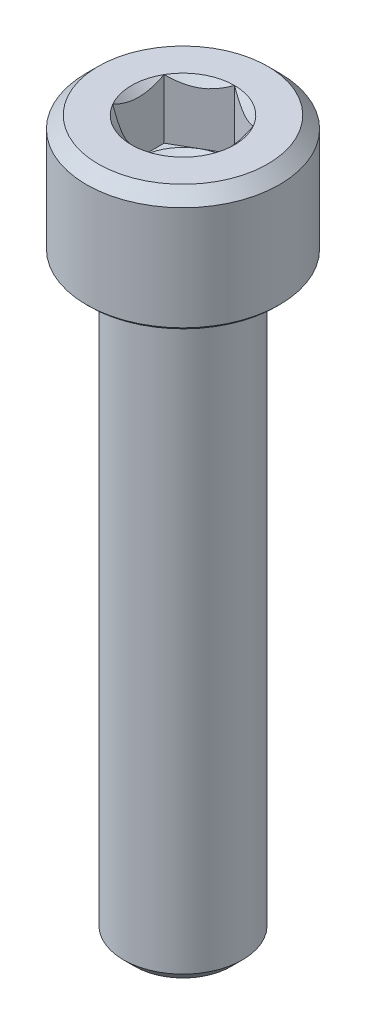
ISO-10303-21;
HEADER;
FILE_DESCRIPTION(('STEP AP214'),'2;1');
FILE_NAME('part.step','',(''),(''),'','','');
FILE_SCHEMA(('AUTOMOTIVE_DESIGN { 1 0 10303 214 1 1 1 1 }'));
ENDSEC;
DATA;
#1=APPLICATION_CONTEXT('core data for automotive mechanical design processes');
#2=APPLICATION_PROTOCOL_DEFINITION('international standard','automotive_design',2000,#1);
#3=PRODUCT_CONTEXT('',#1,'mechanical');
#4=PRODUCT('Part','Part','',(#3));
#5=PRODUCT_RELATED_PRODUCT_CATEGORY('part','',(#4));
#6=PRODUCT_DEFINITION_FORMATION('','',#4);
#7=PRODUCT_DEFINITION_CONTEXT('part definition',#1,'design');
#8=PRODUCT_DEFINITION('design','',#6,#7);
#9=PRODUCT_DEFINITION_SHAPE('','',#8);
#10=(LENGTH_UNIT() NAMED_UNIT(*) SI_UNIT(.MILLI.,.METRE.));
#11=(NAMED_UNIT(*) PLANE_ANGLE_UNIT() SI_UNIT($,.RADIAN.));
#12=(NAMED_UNIT(*) SI_UNIT($,.STERADIAN.) SOLID_ANGLE_UNIT());
#13=UNCERTAINTY_MEASURE_WITH_UNIT(LENGTH_MEASURE(1.E-05),#10,'distance_accuracy_value','');
#14=(GEOMETRIC_REPRESENTATION_CONTEXT(3) GLOBAL_UNCERTAINTY_ASSIGNED_CONTEXT((#13)) GLOBAL_UNIT_ASSIGNED_CONTEXT((#10,
#11,#12)) REPRESENTATION_CONTEXT('',''));
#15=CARTESIAN_POINT('',(0.,0.,0.));
#16=DIRECTION('',(0.,0.,1.));
#17=DIRECTION('',(1.,0.,0.));
#18=AXIS2_PLACEMENT_3D('',#15,#16,#17);
#19=CARTESIAN_POINT('',(0.,8.,0.));
#20=DIRECTION('',(0.,1.,0.));
#21=DIRECTION('',(0.,0.,1.));
#22=AXIS2_PLACEMENT_3D('',#19,#20,#21);
#23=CONICAL_SURFACE('',#22,3.4641016151378,0.785398163397452);
#24=CARTESIAN_POINT('',(0.,8.,0.));
#25=DIRECTION('',(0.,1.,0.));
#26=DIRECTION('',(0.,0.,1.));
#27=AXIS2_PLACEMENT_3D('',#24,#25,#26);
#28=CIRCLE('',#27,3.4641016151378);
#29=CARTESIAN_POINT('',(-3.,8.,-1.7320508075689));
#30=VERTEX_POINT('',#29);
#31=CARTESIAN_POINT('',(-3.00000000000006,8.,1.73205080756887));
#32=VERTEX_POINT('',#31);
#33=EDGE_CURVE('E247',#30,#32,#28,.T.);
#34=ORIENTED_EDGE('',*,*,#33,.T.);
#35=CARTESIAN_POINT('',(-3.,10.5628957611466,5.22730306886255));
#36=CARTESIAN_POINT('',(-3.,10.4288342117401,5.0726713580434));
#37=CARTESIAN_POINT('',(-3.,10.2955494854444,4.91735177230274));
#38=CARTESIAN_POINT('',(-3.,10.0310881377474,4.60480359274617));
#39=CARTESIAN_POINT('',(-3.,9.89991254962811,4.4475741257295));
#40=CARTESIAN_POINT('',(-3.,9.63736618129847,4.12717460522465));
#41=CARTESIAN_POINT('',(-3.,9.50606037443135,3.96395110833711));
#42=CARTESIAN_POINT('',(-3.,9.24743623977035,3.63442449981236));
#43=CARTESIAN_POINT('',(-3.,9.12011692066784,3.46812217041284));
#44=CARTESIAN_POINT('',(-3.,8.87081667139496,3.13119610603762));
#45=CARTESIAN_POINT('',(-3.,8.74884313339933,2.96056687208659));
#46=CARTESIAN_POINT('',(-3.,8.51272102939345,2.61368555328836));
#47=CARTESIAN_POINT('',(-3.,8.39857888119803,2.43742902617456));
#48=CARTESIAN_POINT('',(-3.,8.23676937618543,2.16829069832486));
#49=CARTESIAN_POINT('',(-3.,8.18458231743954,2.07813994406703));
#50=CARTESIAN_POINT('',(-3.,8.08389799079683,1.89580695482969));
#51=CARTESIAN_POINT('',(-3.,8.03540116735631,1.80362447686586));
#52=CARTESIAN_POINT('',(-3.,7.89685543297179,1.52391319393506));
#53=CARTESIAN_POINT('',(-3.,7.81351649159878,1.33284385060797));
#54=CARTESIAN_POINT('',(-3.,7.70855409405216,1.03657424381741));
#55=CARTESIAN_POINT('',(-3.,7.67666695663458,0.935006758603606));
#56=CARTESIAN_POINT('',(-3.,7.62172632743353,0.729476390859867));
#57=CARTESIAN_POINT('',(-3.,7.59867142567072,0.625513893481614));
#58=CARTESIAN_POINT('',(-3.,7.56292742524803,0.41645059180014));
#59=CARTESIAN_POINT('',(-3.,7.55017520011951,0.311360779912042));
#60=CARTESIAN_POINT('',(-3.,7.53573503655797,0.100416824431796));
#61=CARTESIAN_POINT('',(-3.,7.53404593599852,-0.00543723771015925));
#62=CARTESIAN_POINT('',(-3.,7.54186740554813,-0.216859496187063));
#63=CARTESIAN_POINT('',(-3.,7.55139258649607,-0.322427139576685));
#64=CARTESIAN_POINT('',(-3.,7.5809459928178,-0.532070977320128));
#65=CARTESIAN_POINT('',(-3.,7.60097628641626,-0.636146873835313));
#66=CARTESIAN_POINT('',(-3.,7.65040446804356,-0.842791568937395));
#67=CARTESIAN_POINT('',(-3.,7.6798678340041,-0.945344427978178));
#68=CARTESIAN_POINT('',(-3.,7.7465698690676,-1.14784963750902));
#69=CARTESIAN_POINT('',(-3.,7.78380862419282,-1.24780195921453));
#70=CARTESIAN_POINT('',(-3.,7.87370029414245,-1.46734471854927));
#71=CARTESIAN_POINT('',(-3.,7.92793554732397,-1.58628178717262));
#72=CARTESIAN_POINT('',(-3.,8.04363956081995,-1.82061432614214));
#73=CARTESIAN_POINT('',(-3.,8.10511250042274,-1.93600770127382));
#74=CARTESIAN_POINT('',(-3.,8.23368444704772,-2.1639059086434));
#75=CARTESIAN_POINT('',(-3.,8.30079484504482,-2.27640426187093));
#76=CARTESIAN_POINT('',(-3.,8.43923767799413,-2.49872291673084));
#77=CARTESIAN_POINT('',(-3.,8.51056927359537,-2.60854374467607));
#78=CARTESIAN_POINT('',(-3.,8.65691390595835,-2.82654030533701));
#79=CARTESIAN_POINT('',(-3.,8.73194446444504,-2.93470422093315));
#80=CARTESIAN_POINT('',(-3.,8.88464064031789,-3.14916031477082));
#81=CARTESIAN_POINT('',(-3.,8.96230645630098,-3.25545235102371));
#82=CARTESIAN_POINT('',(-3.,9.19824479870631,-3.5717347626675));
#83=CARTESIAN_POINT('',(-3.,9.35963841020625,-3.77939404666679));
#84=CARTESIAN_POINT('',(-3.,9.69321446971949,-4.19691408704107));
#85=CARTESIAN_POINT('',(-3.,9.86557700910658,-4.40662953794659));
#86=CARTESIAN_POINT('',(-3.,10.1262359169538,-4.71751939796388));
#87=CARTESIAN_POINT('',(-3.,10.212996792795,-4.81998746341153));
#88=CARTESIAN_POINT('',(-3.,10.3873521918902,-5.02417406398527));
#89=CARTESIAN_POINT('',(-3.,10.4749465316673,-5.12589275571193));
#90=CARTESIAN_POINT('',(-3.,10.5628957611466,-5.22730306886255));
#91=B_SPLINE_CURVE_WITH_KNOTS('',3,(#35,#36,#37,#38,#39,#40,#41,#42,#43,#44,#45,#46,#47,#48,#49,
#50,#51,#52,#53,#54,#55,#56,#57,#58,#59,#60,#61,#62,#63,#64,#65,#66,#67,#68,#69,#70,#71,#72,#73,
#74,#75,#76,#77,#78,#79,#80,#81,#82,#83,#84,#85,#86,#87,#88,#89,#90),.UNSPECIFIED.,.F.,.F.,(4,2,
2,2,2,2,2,2,2,2,2,2,2,2,2,2,2,2,2,2,2,2,2,2,2,2,2,4),(0.,0.613977244046406,1.22824663827751,
1.8566516828457,2.48489920225136,3.11398969259724,3.74358971179074,4.05600538101289,
4.36845861858335,4.99203707824936,5.31109326862459,5.63009850357821,5.94713398460898,
6.26413616209869,6.58155181217515,6.89902997785464,7.2187614604173,7.53849648048523,
7.93032123433355,8.32237336123124,8.71523765064269,9.10802408295755,9.50289413535101,
9.89779401212494,10.6866391110132,11.5009473099341,11.9037392215787,12.3064444255475),.UNSPECIFIED.);
#92=EDGE_CURVE('E134',#32,#30,#91,.T.);
#93=ORIENTED_EDGE('',*,*,#92,.T.);
#94=EDGE_LOOP('',(#34,#93));
#95=FACE_BOUND('',#94,.T.);
#96=ADVANCED_FACE('F42',(#95),#23,.F.);
#97=CARTESIAN_POINT('',(0.,8.,-3.4641016151378));
#98=VERTEX_POINT('',#97);
#99=EDGE_CURVE('E249',#98,#30,#28,.T.);
#100=ORIENTED_EDGE('',*,*,#99,.T.);
#101=CARTESIAN_POINT('',(-3.0002,8.00011547582711,-1.73193533751506));
#102=CARTESIAN_POINT('',(-2.89707648504425,7.94062831832175,-1.79147372663454));
#103=CARTESIAN_POINT('',(-2.79222861066935,7.88463497946549,-1.85200767512885));
#104=CARTESIAN_POINT('',(-2.57843232821891,7.78211259637891,-1.97544301635336));
#105=CARTESIAN_POINT('',(-2.46946358862025,7.73564059374127,-2.0383561474939));
#106=CARTESIAN_POINT('',(-2.24973336040298,7.65603318851628,-2.16521745390424));
#107=CARTESIAN_POINT('',(-2.1390278282378,7.62269770064265,-2.22913332270059));
#108=CARTESIAN_POINT('',(-1.91517958943469,7.57133754397929,-2.35837216363119));
#109=CARTESIAN_POINT('',(-1.80204372079302,7.55327453753559,-2.42369118784646));
#110=CARTESIAN_POINT('',(-1.60705904380731,7.53697690845048,-2.53626564359201));
#111=CARTESIAN_POINT('',(-1.52546204599788,7.53456436717379,-2.58337569224236));
#112=CARTESIAN_POINT('',(-1.36240077116992,7.5386294346571,-2.67751916315868));
#113=CARTESIAN_POINT('',(-1.28093655070102,7.54511016002829,-2.72455255277572));
#114=CARTESIAN_POINT('',(-1.11877988766164,7.56659172251521,-2.81817374583241));
#115=CARTESIAN_POINT('',(-1.03808841121571,7.58160208996727,-2.86476099147977));
#116=CARTESIAN_POINT('',(-0.878091302108671,7.61932364606601,-2.95713536549228));
#117=CARTESIAN_POINT('',(-0.798785563690709,7.64203424432282,-3.00292255491618));
#118=CARTESIAN_POINT('',(-0.657993859197251,7.68876068485394,-3.08420868340514));
#119=CARTESIAN_POINT('',(-0.596196277853978,7.71154832768079,-3.11988753362895));
#120=CARTESIAN_POINT('',(-0.473710582479783,7.76079628605744,-3.19060468282512));
#121=CARTESIAN_POINT('',(-0.413022502364399,7.78725671366619,-3.22564296221634));
#122=CARTESIAN_POINT('',(-0.292947002609139,7.84325699439136,-3.29496858432312));
#123=CARTESIAN_POINT('',(-0.233556167704084,7.87278716447837,-3.32925789884295));
#124=CARTESIAN_POINT('',(-0.115874438532732,7.93453909157553,-3.39720147685873));
#125=CARTESIAN_POINT('',(-0.0575828957522661,7.96675919665935,-3.43085611477451));
#126=CARTESIAN_POINT('',(0.000200000000000316,8.00011547582715,-3.46421708519164));
#127=B_SPLINE_CURVE_WITH_KNOTS('',3,(#101,#102,#103,#104,#105,#106,#107,#108,#109,#110,#111,
#112,#113,#114,#115,#116,#117,#118,#119,#120,#121,#122,#123,#124,#125,#126),.UNSPECIFIED.,.F.,
.F.,(4,2,2,2,2,2,2,2,2,2,2,2,4),(0.,0.399603557139301,0.801535286397836,1.19708369162341,
1.59163620080171,1.87398941755843,2.15644160919092,2.43921001247424,2.72195674032138,
2.94657516661927,3.17120044767275,3.3951375283781,3.6189380838074),.UNSPECIFIED.);
#128=EDGE_CURVE('E209',#30,#98,#127,.T.);
#129=ORIENTED_EDGE('',*,*,#128,.T.);
#130=EDGE_LOOP('',(#100,#129));
#131=FACE_BOUND('',#130,.T.);
#132=ADVANCED_FACE('F293',(#131),#23,.F.);
#133=CARTESIAN_POINT('',(3.,8.,-1.7320508075689));
#134=VERTEX_POINT('',#133);
#135=EDGE_CURVE('E246',#134,#98,#28,.T.);
#136=ORIENTED_EDGE('',*,*,#135,.T.);
#137=CARTESIAN_POINT('',(-0.000200000000000127,8.00011547582715,-3.46421708519164));
#138=CARTESIAN_POINT('',(0.10292351495575,7.94062831832178,-3.40467869607216));
#139=CARTESIAN_POINT('',(0.207771389330655,7.88463497946552,-3.34414474757784));
#140=CARTESIAN_POINT('',(0.421567671781105,7.78211259637893,-3.22070940635333));
#141=CARTESIAN_POINT('',(0.530536411379772,7.73564059374128,-3.15779627521279));
#142=CARTESIAN_POINT('',(0.750266639597046,7.65603318851629,-3.03093496880244));
#143=CARTESIAN_POINT('',(0.860972171762232,7.62269770064266,-2.96701910000609));
#144=CARTESIAN_POINT('',(1.08482041056535,7.57133754397929,-2.83778025907549));
#145=CARTESIAN_POINT('',(1.19795627920702,7.55327453753559,-2.77246123486021));
#146=CARTESIAN_POINT('',(1.39294095619273,7.53697690845048,-2.65988677911466));
#147=CARTESIAN_POINT('',(1.47453795400217,7.53456436717379,-2.61277673046432));
#148=CARTESIAN_POINT('',(1.63759922883013,7.5386294346571,-2.51863325954799));
#149=CARTESIAN_POINT('',(1.71906344929903,7.54511016002829,-2.47159986993095));
#150=CARTESIAN_POINT('',(1.88122011233841,7.56659172251521,-2.37797867687427));
#151=CARTESIAN_POINT('',(1.96191158878434,7.58160208996727,-2.3313914312269));
#152=CARTESIAN_POINT('',(2.12190869789138,7.619323646066,-2.23901705721439));
#153=CARTESIAN_POINT('',(2.20121443630934,7.64203424432282,-2.1932298677905));
#154=CARTESIAN_POINT('',(2.34200614080279,7.68876068485393,-2.11194373930153));
#155=CARTESIAN_POINT('',(2.40380372214606,7.71154832768079,-2.07626488907773));
#156=CARTESIAN_POINT('',(2.52628941752025,7.76079628605743,-2.00554773988156));
#157=CARTESIAN_POINT('',(2.58697749763563,7.78725671366618,-1.97050946049035));
#158=CARTESIAN_POINT('',(2.70705299739088,7.84325699439134,-1.90118383838357));
#159=CARTESIAN_POINT('',(2.76644383229593,7.87278716447835,-1.86689452386374));
#160=CARTESIAN_POINT('',(2.88412556146728,7.9345390915755,-1.79895094584797));
#161=CARTESIAN_POINT('',(2.94241710424774,7.96675919665932,-1.76529630793219));
#162=CARTESIAN_POINT('',(3.0002,8.00011547582711,-1.73193533751506));
#163=B_SPLINE_CURVE_WITH_KNOTS('',3,(#137,#138,#139,#140,#141,#142,#143,#144,#145,#146,#147,
#148,#149,#150,#151,#152,#153,#154,#155,#156,#157,#158,#159,#160,#161,#162),.UNSPECIFIED.,.F.,
.F.,(4,2,2,2,2,2,2,2,2,2,2,2,4),(0.,0.399603557139317,0.801535286397867,1.19708369162346,
1.59163620080177,1.87398941755849,2.15644160919098,2.43921001247431,2.72195674032144,
2.94657516661932,3.17120044767278,3.39513752837812,3.6189380838074),.UNSPECIFIED.);
#164=EDGE_CURVE('E260',#98,#134,#163,.T.);
#165=ORIENTED_EDGE('',*,*,#164,.T.);
#166=EDGE_LOOP('',(#136,#165));
#167=FACE_BOUND('',#166,.T.);
#168=ADVANCED_FACE('F258',(#167),#23,.F.);
#169=CARTESIAN_POINT('',(3.,8.,1.7320508075689));
#170=VERTEX_POINT('',#169);
#171=EDGE_CURVE('E241',#170,#134,#28,.T.);
#172=ORIENTED_EDGE('',*,*,#171,.T.);
#173=CARTESIAN_POINT('',(3.,10.5628957611466,-5.22730306886255));
#174=CARTESIAN_POINT('',(3.,10.4288342117401,-5.0726713580434));
#175=CARTESIAN_POINT('',(3.,10.2955494854444,-4.91735177230274));
#176=CARTESIAN_POINT('',(3.,10.0310881377474,-4.60480359274617));
#177=CARTESIAN_POINT('',(3.,9.89991254962811,-4.4475741257295));
#178=CARTESIAN_POINT('',(3.,9.63736618129847,-4.12717460522465));
#179=CARTESIAN_POINT('',(3.,9.50606037443135,-3.96395110833711));
#180=CARTESIAN_POINT('',(3.,9.24743623977035,-3.63442449981236));
#181=CARTESIAN_POINT('',(3.,9.12011692066784,-3.46812217041284));
#182=CARTESIAN_POINT('',(3.,8.87081667139496,-3.13119610603762));
#183=CARTESIAN_POINT('',(3.,8.74884313339933,-2.96056687208659));
#184=CARTESIAN_POINT('',(3.,8.51272102939345,-2.61368555328836));
#185=CARTESIAN_POINT('',(3.,8.39857888119803,-2.43742902617456));
#186=CARTESIAN_POINT('',(3.,8.23676937618543,-2.16829069832486));
#187=CARTESIAN_POINT('',(3.,8.18458231743954,-2.07813994406703));
#188=CARTESIAN_POINT('',(3.,8.08389799079683,-1.89580695482969));
#189=CARTESIAN_POINT('',(3.,8.03540116735631,-1.80362447686586));
#190=CARTESIAN_POINT('',(3.,7.89685543297179,-1.52391319393506));
#191=CARTESIAN_POINT('',(3.,7.81351649159878,-1.33284385060797));
#192=CARTESIAN_POINT('',(3.,7.70855409405216,-1.03657424381741));
#193=CARTESIAN_POINT('',(3.,7.67666695663458,-0.935006758603606));
#194=CARTESIAN_POINT('',(3.,7.62172632743353,-0.729476390859867));
#195=CARTESIAN_POINT('',(3.,7.59867142567072,-0.625513893481614));
#196=CARTESIAN_POINT('',(3.,7.56292742524803,-0.41645059180014));
#197=CARTESIAN_POINT('',(3.,7.55017520011951,-0.311360779912042));
#198=CARTESIAN_POINT('',(3.,7.53573503655797,-0.100416824431796));
#199=CARTESIAN_POINT('',(3.,7.53404593599852,0.00543723771015925));
#200=CARTESIAN_POINT('',(3.,7.54186740554813,0.216859496187063));
#201=CARTESIAN_POINT('',(3.,7.55139258649607,0.322427139576685));
#202=CARTESIAN_POINT('',(3.,7.5809459928178,0.532070977320128));
#203=CARTESIAN_POINT('',(3.,7.60097628641626,0.636146873835313));
#204=CARTESIAN_POINT('',(3.,7.65040446804356,0.842791568937395));
#205=CARTESIAN_POINT('',(3.,7.6798678340041,0.945344427978178));
#206=CARTESIAN_POINT('',(3.,7.7465698690676,1.14784963750902));
#207=CARTESIAN_POINT('',(3.,7.78380862419282,1.24780195921453));
#208=CARTESIAN_POINT('',(3.,7.87370029414245,1.46734471854927));
#209=CARTESIAN_POINT('',(3.,7.92793554732397,1.58628178717262));
#210=CARTESIAN_POINT('',(3.,8.04363956081995,1.82061432614214));
#211=CARTESIAN_POINT('',(3.,8.10511250042274,1.93600770127382));
#212=CARTESIAN_POINT('',(3.,8.23368444704772,2.1639059086434));
#213=CARTESIAN_POINT('',(3.,8.30079484504482,2.27640426187093));
#214=CARTESIAN_POINT('',(3.,8.43923767799413,2.49872291673084));
#215=CARTESIAN_POINT('',(3.,8.51056927359537,2.60854374467607));
#216=CARTESIAN_POINT('',(3.,8.65691390595835,2.82654030533701));
#217=CARTESIAN_POINT('',(3.,8.73194446444504,2.93470422093315));
#218=CARTESIAN_POINT('',(3.,8.88464064031789,3.14916031477082));
#219=CARTESIAN_POINT('',(3.,8.96230645630098,3.25545235102371));
#220=CARTESIAN_POINT('',(3.,9.19824479870631,3.5717347626675));
#221=CARTESIAN_POINT('',(3.,9.35963841020625,3.77939404666679));
#222=CARTESIAN_POINT('',(3.,9.69321446971949,4.19691408704107));
#223=CARTESIAN_POINT('',(3.,9.86557700910658,4.40662953794659));
#224=CARTESIAN_POINT('',(3.,10.1262359169538,4.71751939796388));
#225=CARTESIAN_POINT('',(3.,10.212996792795,4.81998746341153));
#226=CARTESIAN_POINT('',(3.,10.3873521918902,5.02417406398527));
#227=CARTESIAN_POINT('',(3.,10.4749465316673,5.12589275571193));
#228=CARTESIAN_POINT('',(3.,10.5628957611466,5.22730306886255));
#229=B_SPLINE_CURVE_WITH_KNOTS('',3,(#173,#174,#175,#176,#177,#178,#179,#180,#181,#182,#183,
#184,#185,#186,#187,#188,#189,#190,#191,#192,#193,#194,#195,#196,#197,#198,#199,#200,#201,#202,
#203,#204,#205,#206,#207,#208,#209,#210,#211,#212,#213,#214,#215,#216,#217,#218,#219,#220,#221,
#222,#223,#224,#225,#226,#227,#228),.UNSPECIFIED.,.F.,.F.,(4,2,2,2,2,2,2,2,2,2,2,2,2,2,2,2,2,2,
2,2,2,2,2,2,2,2,2,4),(0.,0.613977244046406,1.22824663827751,1.8566516828457,2.48489920225136,
3.11398969259724,3.74358971179074,4.05600538101289,4.36845861858335,4.99203707824936,
5.31109326862459,5.63009850357821,5.94713398460898,6.26413616209869,6.58155181217515,
6.89902997785464,7.2187614604173,7.53849648048523,7.93032123433355,8.32237336123124,
8.71523765064269,9.10802408295755,9.50289413535101,9.89779401212494,10.6866391110132,
11.5009473099341,11.9037392215787,12.3064444255475),.UNSPECIFIED.);
#230=EDGE_CURVE('E268',#134,#170,#229,.T.);
#231=ORIENTED_EDGE('',*,*,#230,.T.);
#232=EDGE_LOOP('',(#172,#231));
#233=FACE_BOUND('',#232,.T.);
#234=ADVANCED_FACE('F267',(#233),#23,.F.);
#235=CARTESIAN_POINT('',(0.,8.,3.4641016151378));
#236=VERTEX_POINT('',#235);
#237=EDGE_CURVE('E239',#236,#170,#28,.T.);
#238=ORIENTED_EDGE('',*,*,#237,.T.);
#239=CARTESIAN_POINT('',(3.0002,8.00011547582711,1.73193533751506));
#240=CARTESIAN_POINT('',(2.89707648504425,7.94062831832175,1.79147372663454));
#241=CARTESIAN_POINT('',(2.79222861066935,7.88463497946549,1.85200767512885));
#242=CARTESIAN_POINT('',(2.57843232821891,7.78211259637891,1.97544301635336));
#243=CARTESIAN_POINT('',(2.46946358862025,7.73564059374127,2.0383561474939));
#244=CARTESIAN_POINT('',(2.24973336040298,7.65603318851628,2.16521745390424));
#245=CARTESIAN_POINT('',(2.1390278282378,7.62269770064265,2.22913332270059));
#246=CARTESIAN_POINT('',(1.91517958943469,7.57133754397929,2.35837216363119));
#247=CARTESIAN_POINT('',(1.80204372079302,7.55327453753559,2.42369118784646));
#248=CARTESIAN_POINT('',(1.60705904380731,7.53697690845048,2.53626564359201));
#249=CARTESIAN_POINT('',(1.52546204599788,7.53456436717379,2.58337569224236));
#250=CARTESIAN_POINT('',(1.36240077116992,7.5386294346571,2.67751916315868));
#251=CARTESIAN_POINT('',(1.28093655070102,7.54511016002829,2.72455255277572));
#252=CARTESIAN_POINT('',(1.11877988766164,7.56659172251521,2.81817374583241));
#253=CARTESIAN_POINT('',(1.03808841121571,7.58160208996727,2.86476099147977));
#254=CARTESIAN_POINT('',(0.878091302108671,7.61932364606601,2.95713536549228));
#255=CARTESIAN_POINT('',(0.798785563690709,7.64203424432282,3.00292255491618));
#256=CARTESIAN_POINT('',(0.657993859197251,7.68876068485394,3.08420868340514));
#257=CARTESIAN_POINT('',(0.596196277853978,7.71154832768079,3.11988753362895));
#258=CARTESIAN_POINT('',(0.473710582479783,7.76079628605744,3.19060468282512));
#259=CARTESIAN_POINT('',(0.413022502364399,7.78725671366619,3.22564296221634));
#260=CARTESIAN_POINT('',(0.292947002609139,7.84325699439136,3.29496858432312));
#261=CARTESIAN_POINT('',(0.233556167704084,7.87278716447837,3.32925789884295));
#262=CARTESIAN_POINT('',(0.115874438532732,7.93453909157553,3.39720147685873));
#263=CARTESIAN_POINT('',(0.0575828957522661,7.96675919665935,3.43085611477451));
#264=CARTESIAN_POINT('',(-0.000200000000000316,8.00011547582715,3.46421708519164));
#265=B_SPLINE_CURVE_WITH_KNOTS('',3,(#239,#240,#241,#242,#243,#244,#245,#246,#247,#248,#249,
#250,#251,#252,#253,#254,#255,#256,#257,#258,#259,#260,#261,#262,#263,#264),.UNSPECIFIED.,.F.,
.F.,(4,2,2,2,2,2,2,2,2,2,2,2,4),(0.,0.399603557139301,0.801535286397836,1.19708369162341,
1.59163620080171,1.87398941755843,2.15644160919092,2.43921001247424,2.72195674032138,
2.94657516661927,3.17120044767275,3.3951375283781,3.6189380838074),.UNSPECIFIED.);
#266=EDGE_CURVE('E178',#170,#236,#265,.T.);
#267=ORIENTED_EDGE('',*,*,#266,.T.);
#268=EDGE_LOOP('',(#238,#267));
#269=FACE_BOUND('',#268,.T.);
#270=ADVANCED_FACE('F298',(#269),#23,.F.);
#271=EDGE_CURVE('E238',#32,#236,#28,.T.);
#272=ORIENTED_EDGE('',*,*,#271,.T.);
#273=CARTESIAN_POINT('',(0.000200000000000127,8.00011547582715,3.46421708519164));
#274=CARTESIAN_POINT('',(-0.10292351495575,7.94062831832178,3.40467869607216));
#275=CARTESIAN_POINT('',(-0.207771389330655,7.88463497946552,3.34414474757784));
#276=CARTESIAN_POINT('',(-0.421567671781105,7.78211259637893,3.22070940635333));
#277=CARTESIAN_POINT('',(-0.530536411379772,7.73564059374128,3.15779627521279));
#278=CARTESIAN_POINT('',(-0.750266639597046,7.65603318851629,3.03093496880244));
#279=CARTESIAN_POINT('',(-0.860972171762232,7.62269770064266,2.96701910000609));
#280=CARTESIAN_POINT('',(-1.08482041056535,7.57133754397929,2.83778025907549));
#281=CARTESIAN_POINT('',(-1.19795627920702,7.55327453753559,2.77246123486021));
#282=CARTESIAN_POINT('',(-1.39294095619273,7.53697690845048,2.65988677911466));
#283=CARTESIAN_POINT('',(-1.47453795400217,7.53456436717379,2.61277673046432));
#284=CARTESIAN_POINT('',(-1.63759922883013,7.5386294346571,2.51863325954799));
#285=CARTESIAN_POINT('',(-1.71906344929903,7.54511016002829,2.47159986993095));
#286=CARTESIAN_POINT('',(-1.88122011233841,7.56659172251521,2.37797867687427));
#287=CARTESIAN_POINT('',(-1.96191158878434,7.58160208996727,2.3313914312269));
#288=CARTESIAN_POINT('',(-2.12190869789138,7.619323646066,2.23901705721439));
#289=CARTESIAN_POINT('',(-2.20121443630934,7.64203424432282,2.1932298677905));
#290=CARTESIAN_POINT('',(-2.34200614080279,7.68876068485393,2.11194373930153));
#291=CARTESIAN_POINT('',(-2.40380372214606,7.71154832768079,2.07626488907773));
#292=CARTESIAN_POINT('',(-2.52628941752025,7.76079628605743,2.00554773988156));
#293=CARTESIAN_POINT('',(-2.58697749763563,7.78725671366618,1.97050946049035));
#294=CARTESIAN_POINT('',(-2.70705299739088,7.84325699439134,1.90118383838357));
#295=CARTESIAN_POINT('',(-2.76644383229593,7.87278716447835,1.86689452386374));
#296=CARTESIAN_POINT('',(-2.88412556146728,7.9345390915755,1.79895094584797));
#297=CARTESIAN_POINT('',(-2.94241710424774,7.96675919665932,1.76529630793219));
#298=CARTESIAN_POINT('',(-3.0002,8.00011547582711,1.73193533751506));
#299=B_SPLINE_CURVE_WITH_KNOTS('',3,(#273,#274,#275,#276,#277,#278,#279,#280,#281,#282,#283,
#284,#285,#286,#287,#288,#289,#290,#291,#292,#293,#294,#295,#296,#297,#298),.UNSPECIFIED.,.F.,
.F.,(4,2,2,2,2,2,2,2,2,2,2,2,4),(0.,0.399603557139317,0.801535286397867,1.19708369162346,
1.59163620080177,1.87398941755849,2.15644160919098,2.43921001247431,2.72195674032144,
2.94657516661932,3.17120044767278,3.39513752837812,3.6189380838074),.UNSPECIFIED.);
#300=EDGE_CURVE('E65',#236,#32,#299,.T.);
#301=ORIENTED_EDGE('',*,*,#300,.T.);
#302=EDGE_LOOP('',(#272,#301));
#303=FACE_BOUND('',#302,.T.);
#304=ADVANCED_FACE('F185',(#303),#23,.F.);
#305=CARTESIAN_POINT('',(3.4641016151378,8.,0.));
#306=DIRECTION('',(0.,-1.,0.));
#307=DIRECTION('',(0.,0.,-1.));
#308=AXIS2_PLACEMENT_3D('',#305,#306,#307);
#309=PLANE('',#308);
#310=ORIENTED_EDGE('',*,*,#237,.F.);
#311=ORIENTED_EDGE('',*,*,#271,.F.);
#312=ORIENTED_EDGE('',*,*,#33,.F.);
#313=ORIENTED_EDGE('',*,*,#99,.F.);
#314=ORIENTED_EDGE('',*,*,#135,.F.);
#315=ORIENTED_EDGE('',*,*,#171,.F.);
#316=EDGE_LOOP('',(#310,#311,#312,#313,#314,#315));
#317=FACE_BOUND('',#316,.T.);
#318=CARTESIAN_POINT('',(0.,8.,0.));
#319=DIRECTION('',(0.,1.,0.));
#320=DIRECTION('',(0.,0.,1.));
#321=AXIS2_PLACEMENT_3D('',#318,#319,#320);
#322=CIRCLE('',#321,5.7);
#323=CARTESIAN_POINT('',(0.,8.,5.7));
#324=VERTEX_POINT('',#323);
#325=EDGE_CURVE('E236',#324,#324,#322,.T.);
#326=ORIENTED_EDGE('',*,*,#325,.T.);
#327=EDGE_LOOP('',(#326));
#328=FACE_BOUND('',#327,.T.);
#329=ADVANCED_FACE('F264',(#317,#328),#309,.F.);
#330=CARTESIAN_POINT('',(0.,7.2,0.));
#331=DIRECTION('',(0.,-1.,0.));
#332=DIRECTION('',(0.,0.,-1.));
#333=AXIS2_PLACEMENT_3D('',#330,#331,#332);
#334=CONICAL_SURFACE('',#333,6.5,0.785398163397447);
#335=ORIENTED_EDGE('',*,*,#325,.F.);
#336=EDGE_LOOP('',(#335));
#337=FACE_BOUND('',#336,.T.);
#338=CARTESIAN_POINT('',(0.,7.2,0.));
#339=DIRECTION('',(0.,1.,0.));
#340=DIRECTION('',(0.,0.,1.));
#341=AXIS2_PLACEMENT_3D('',#338,#339,#340);
#342=CIRCLE('',#341,6.5);
#343=CARTESIAN_POINT('',(0.,7.2,6.5));
#344=VERTEX_POINT('',#343);
#345=EDGE_CURVE('E233',#344,#344,#342,.T.);
#346=ORIENTED_EDGE('',*,*,#345,.T.);
#347=EDGE_LOOP('',(#346));
#348=FACE_BOUND('',#347,.T.);
#349=ADVANCED_FACE('F303',(#337,#348),#334,.T.);
#350=CARTESIAN_POINT('',(0.,-40.,0.));
#351=DIRECTION('',(0.,1.,0.));
#352=DIRECTION('',(0.,0.,1.));
#353=AXIS2_PLACEMENT_3D('',#350,#351,#352);
#354=CYLINDRICAL_SURFACE('',#353,6.5);
#355=ORIENTED_EDGE('',*,*,#345,.F.);
#356=EDGE_LOOP('',(#355));
#357=FACE_BOUND('',#356,.T.);
#358=CARTESIAN_POINT('',(0.,0.199999999999999,0.));
#359=DIRECTION('',(0.,1.,0.));
#360=DIRECTION('',(0.,0.,1.));
#361=AXIS2_PLACEMENT_3D('',#358,#359,#360);
#362=CIRCLE('',#361,6.5);
#363=CARTESIAN_POINT('',(0.,0.199999999999999,6.5));
#364=VERTEX_POINT('',#363);
#365=EDGE_CURVE('E230',#364,#364,#362,.T.);
#366=ORIENTED_EDGE('',*,*,#365,.T.);
#367=EDGE_LOOP('',(#366));
#368=FACE_BOUND('',#367,.T.);
#369=ADVANCED_FACE('F449',(#357,#368),#354,.T.);
#370=CARTESIAN_POINT('',(0.,0.,0.));
#371=DIRECTION('',(0.,1.,0.));
#372=DIRECTION('',(0.,0.,1.));
#373=AXIS2_PLACEMENT_3D('',#370,#371,#372);
#374=CONICAL_SURFACE('',#373,6.3,0.785398163397453);
#375=ORIENTED_EDGE('',*,*,#365,.F.);
#376=EDGE_LOOP('',(#375));
#377=FACE_BOUND('',#376,.T.);
#378=CARTESIAN_POINT('',(0.,0.,0.));
#379=DIRECTION('',(0.,1.,0.));
#380=DIRECTION('',(0.,0.,1.));
#381=AXIS2_PLACEMENT_3D('',#378,#379,#380);
#382=CIRCLE('',#381,6.3);
#383=CARTESIAN_POINT('',(0.,0.,6.3));
#384=VERTEX_POINT('',#383);
#385=EDGE_CURVE('E227',#384,#384,#382,.T.);
#386=ORIENTED_EDGE('',*,*,#385,.T.);
#387=EDGE_LOOP('',(#386));
#388=FACE_BOUND('',#387,.T.);
#389=ADVANCED_FACE('F430',(#377,#388),#374,.T.);
#390=CARTESIAN_POINT('',(6.3,0.,0.));
#391=DIRECTION('',(0.,1.,0.));
#392=DIRECTION('',(0.,0.,1.));
#393=AXIS2_PLACEMENT_3D('',#390,#391,#392);
#394=PLANE('',#393);
#395=ORIENTED_EDGE('',*,*,#385,.F.);
#396=EDGE_LOOP('',(#395));
#397=FACE_BOUND('',#396,.T.);
#398=CARTESIAN_POINT('',(0.,0.,0.));
#399=DIRECTION('',(0.,1.,0.));
#400=DIRECTION('',(0.,0.,1.));
#401=AXIS2_PLACEMENT_3D('',#398,#399,#400);
#402=CIRCLE('',#401,4.05);
#403=CARTESIAN_POINT('',(0.,0.,4.05));
#404=VERTEX_POINT('',#403);
#405=EDGE_CURVE('E224',#404,#404,#402,.T.);
#406=ORIENTED_EDGE('',*,*,#405,.T.);
#407=EDGE_LOOP('',(#406));
#408=FACE_BOUND('',#407,.T.);
#409=ADVANCED_FACE('F424',(#397,#408),#394,.F.);
#410=CARTESIAN_POINT('',(0.,-1.02,0.));
#411=DIRECTION('',(0.,1.,0.));
#412=DIRECTION('',(0.,0.,1.));
#413=AXIS2_PLACEMENT_3D('',#410,#411,#412);
#414=CONICAL_SURFACE('',#413,4.,0.0489804009237269);
#415=ORIENTED_EDGE('',*,*,#405,.F.);
#416=EDGE_LOOP('',(#415));
#417=FACE_BOUND('',#416,.T.);
#418=CARTESIAN_POINT('',(0.,-1.02,0.));
#419=DIRECTION('',(0.,1.,0.));
#420=DIRECTION('',(0.,0.,1.));
#421=AXIS2_PLACEMENT_3D('',#418,#419,#420);
#422=CIRCLE('',#421,4.);
#423=CARTESIAN_POINT('',(0.,-1.02,4.));
#424=VERTEX_POINT('',#423);
#425=EDGE_CURVE('E221',#424,#424,#422,.T.);
#426=ORIENTED_EDGE('',*,*,#425,.T.);
#427=EDGE_LOOP('',(#426));
#428=FACE_BOUND('',#427,.T.);
#429=ADVANCED_FACE('F429',(#417,#428),#414,.T.);
#430=CARTESIAN_POINT('',(0.,-40.,0.));
#431=DIRECTION('',(0.,1.,0.));
#432=DIRECTION('',(0.,0.,1.));
#433=AXIS2_PLACEMENT_3D('',#430,#431,#432);
#434=CYLINDRICAL_SURFACE('',#433,4.);
#435=ORIENTED_EDGE('',*,*,#425,.F.);
#436=EDGE_LOOP('',(#435));
#437=FACE_BOUND('',#436,.T.);
#438=CARTESIAN_POINT('',(0.,-39.233,0.));
#439=DIRECTION('',(0.,1.,0.));
#440=DIRECTION('',(0.,0.,1.));
#441=AXIS2_PLACEMENT_3D('',#438,#439,#440);
#442=CIRCLE('',#441,4.);
#443=CARTESIAN_POINT('',(0.,-39.233,4.));
#444=VERTEX_POINT('',#443);
#445=EDGE_CURVE('E218',#444,#444,#442,.T.);
#446=ORIENTED_EDGE('',*,*,#445,.T.);
#447=EDGE_LOOP('',(#446));
#448=FACE_BOUND('',#447,.T.);
#449=ADVANCED_FACE('F471',(#437,#448),#434,.T.);
#450=CARTESIAN_POINT('',(0.,-40.,0.));
#451=DIRECTION('',(0.,1.,0.));
#452=DIRECTION('',(0.,0.,1.));
#453=AXIS2_PLACEMENT_3D('',#450,#451,#452);
#454=CONICAL_SURFACE('',#453,3.233,0.785398163397446);
#455=ORIENTED_EDGE('',*,*,#445,.F.);
#456=EDGE_LOOP('',(#455));
#457=FACE_BOUND('',#456,.T.);
#458=CARTESIAN_POINT('',(0.,-40.,0.));
#459=DIRECTION('',(0.,1.,0.));
#460=DIRECTION('',(0.,0.,1.));
#461=AXIS2_PLACEMENT_3D('',#458,#459,#460);
#462=CIRCLE('',#461,3.233);
#463=CARTESIAN_POINT('',(0.,-40.,3.233));
#464=VERTEX_POINT('',#463);
#465=EDGE_CURVE('E208',#464,#464,#462,.T.);
#466=ORIENTED_EDGE('',*,*,#465,.T.);
#467=EDGE_LOOP('',(#466));
#468=FACE_BOUND('',#467,.T.);
#469=ADVANCED_FACE('F417',(#457,#468),#454,.T.);
#470=CARTESIAN_POINT('',(3.233,-40.,0.));
#471=DIRECTION('',(0.,1.,0.));
#472=DIRECTION('',(0.,0.,1.));
#473=AXIS2_PLACEMENT_3D('',#470,#471,#472);
#474=PLANE('',#473);
#475=ORIENTED_EDGE('',*,*,#465,.F.);
#476=EDGE_LOOP('',(#475));
#477=FACE_BOUND('',#476,.T.);
#478=ADVANCED_FACE('F199',(#477),#474,.F.);
#479=CARTESIAN_POINT('',(0.,4.,0.));
#480=DIRECTION('',(0.,1.,0.));
#481=DIRECTION('',(0.,0.,1.));
#482=AXIS2_PLACEMENT_3D('',#479,#480,#481);
#483=PLANE('',#482);
#484=CARTESIAN_POINT('',(0.,4.,0.));
#485=DIRECTION('',(0.,1.,0.));
#486=DIRECTION('',(0.,0.,1.));
#487=AXIS2_PLACEMENT_3D('',#484,#485,#486);
#488=CIRCLE('',#487,3.);
#489=CARTESIAN_POINT('',(-3.,4.,0.));
#490=VERTEX_POINT('',#489);
#491=CARTESIAN_POINT('',(-1.50000000000003,4.,2.59807621135333));
#492=VERTEX_POINT('',#491);
#493=EDGE_CURVE('E124',#490,#492,#488,.T.);
#494=ORIENTED_EDGE('',*,*,#493,.F.);
#495=DIRECTION('',(0.,0.,1.));
#496=VECTOR('',#495,1.);
#497=CARTESIAN_POINT('',(-3.,4.,-1.7320508075689));
#498=LINE('',#497,#496);
#499=CARTESIAN_POINT('',(-3.,4.,1.7320508075689));
#500=VERTEX_POINT('',#499);
#501=EDGE_CURVE('E118',#490,#500,#498,.T.);
#502=ORIENTED_EDGE('',*,*,#501,.T.);
#503=DIRECTION('',(0.866025403784436,0.,0.500000000000005));
#504=VECTOR('',#503,1.);
#505=CARTESIAN_POINT('',(-3.,4.,1.7320508075689));
#506=LINE('',#505,#504);
#507=EDGE_CURVE('E122',#500,#492,#506,.T.);
#508=ORIENTED_EDGE('',*,*,#507,.T.);
#509=EDGE_LOOP('',(#494,#502,#508));
#510=FACE_BOUND('',#509,.T.);
#511=ADVANCED_FACE('F120',(#510),#483,.T.);
#512=CARTESIAN_POINT('',(-1.50000000000003,4.,-2.59807621135333));
#513=VERTEX_POINT('',#512);
#514=EDGE_CURVE('E594',#513,#490,#488,.T.);
#515=ORIENTED_EDGE('',*,*,#514,.F.);
#516=DIRECTION('',(-0.866025403784436,0.,0.500000000000005));
#517=VECTOR('',#516,1.);
#518=CARTESIAN_POINT('',(0.,4.,-3.4641016151378));
#519=LINE('',#518,#517);
#520=CARTESIAN_POINT('',(-3.,4.,-1.7320508075689));
#521=VERTEX_POINT('',#520);
#522=EDGE_CURVE('E156',#513,#521,#519,.T.);
#523=ORIENTED_EDGE('',*,*,#522,.T.);
#524=EDGE_CURVE('E128',#521,#490,#498,.T.);
#525=ORIENTED_EDGE('',*,*,#524,.T.);
#526=EDGE_LOOP('',(#515,#523,#525));
#527=FACE_BOUND('',#526,.T.);
#528=ADVANCED_FACE('F291',(#527),#483,.T.);
#529=CARTESIAN_POINT('',(1.50000000000003,4.,-2.59807621135333));
#530=VERTEX_POINT('',#529);
#531=EDGE_CURVE('E597',#530,#513,#488,.T.);
#532=ORIENTED_EDGE('',*,*,#531,.F.);
#533=DIRECTION('',(-0.866025403784436,0.,-0.500000000000005));
#534=VECTOR('',#533,1.);
#535=CARTESIAN_POINT('',(3.,4.,-1.7320508075689));
#536=LINE('',#535,#534);
#537=CARTESIAN_POINT('',(0.,4.,-3.4641016151378));
#538=VERTEX_POINT('',#537);
#539=EDGE_CURVE('E152',#530,#538,#536,.T.);
#540=ORIENTED_EDGE('',*,*,#539,.T.);
#541=EDGE_CURVE('E138',#538,#513,#519,.T.);
#542=ORIENTED_EDGE('',*,*,#541,.T.);
#543=EDGE_LOOP('',(#532,#540,#542));
#544=FACE_BOUND('',#543,.T.);
#545=ADVANCED_FACE('F380',(#544),#483,.T.);
#546=CARTESIAN_POINT('',(3.,4.,0.));
#547=VERTEX_POINT('',#546);
#548=EDGE_CURVE('E50',#547,#530,#488,.T.);
#549=ORIENTED_EDGE('',*,*,#548,.F.);
#550=DIRECTION('',(0.,0.,-1.));
#551=VECTOR('',#550,1.);
#552=CARTESIAN_POINT('',(3.,4.,1.7320508075689));
#553=LINE('',#552,#551);
#554=CARTESIAN_POINT('',(3.,4.,-1.7320508075689));
#555=VERTEX_POINT('',#554);
#556=EDGE_CURVE('E148',#547,#555,#553,.T.);
#557=ORIENTED_EDGE('',*,*,#556,.T.);
#558=EDGE_CURVE('E153',#555,#530,#536,.T.);
#559=ORIENTED_EDGE('',*,*,#558,.T.);
#560=EDGE_LOOP('',(#549,#557,#559));
#561=FACE_BOUND('',#560,.T.);
#562=ADVANCED_FACE('F289',(#561),#483,.T.);
#563=CARTESIAN_POINT('',(1.50000000000002,4.,2.59807621135331));
#564=VERTEX_POINT('',#563);
#565=EDGE_CURVE('E11',#564,#547,#488,.T.);
#566=ORIENTED_EDGE('',*,*,#565,.F.);
#567=DIRECTION('',(0.866025403784436,0.,-0.500000000000005));
#568=VECTOR('',#567,1.);
#569=CARTESIAN_POINT('',(0.,4.,3.4641016151378));
#570=LINE('',#569,#568);
#571=CARTESIAN_POINT('',(3.,4.,1.7320508075689));
#572=VERTEX_POINT('',#571);
#573=EDGE_CURVE('E144',#564,#572,#570,.T.);
#574=ORIENTED_EDGE('',*,*,#573,.T.);
#575=EDGE_CURVE('E149',#572,#547,#553,.T.);
#576=ORIENTED_EDGE('',*,*,#575,.T.);
#577=EDGE_LOOP('',(#566,#574,#576));
#578=FACE_BOUND('',#577,.T.);
#579=ADVANCED_FACE('F279',(#578),#483,.T.);
#580=EDGE_CURVE('E51',#492,#564,#488,.T.);
#581=ORIENTED_EDGE('',*,*,#580,.F.);
#582=CARTESIAN_POINT('',(0.,4.,3.4641016151378));
#583=VERTEX_POINT('',#582);
#584=EDGE_CURVE('E143',#492,#583,#506,.T.);
#585=ORIENTED_EDGE('',*,*,#584,.T.);
#586=EDGE_CURVE('E58',#583,#564,#570,.T.);
#587=ORIENTED_EDGE('',*,*,#586,.T.);
#588=EDGE_LOOP('',(#581,#585,#587));
#589=FACE_BOUND('',#588,.T.);
#590=ADVANCED_FACE('F198',(#589),#483,.T.);
#591=CARTESIAN_POINT('',(-3.,4.,-1.7320508075689));
#592=DIRECTION('',(-1.,0.,0.));
#593=DIRECTION('',(0.,0.,1.));
#594=AXIS2_PLACEMENT_3D('',#591,#592,#593);
#595=PLANE('',#594);
#596=ORIENTED_EDGE('',*,*,#92,.F.);
#597=DIRECTION('',(0.,1.,0.));
#598=VECTOR('',#597,1.);
#599=CARTESIAN_POINT('',(-3.,4.,1.7320508075689));
#600=LINE('',#599,#598);
#601=EDGE_CURVE('E131',#500,#32,#600,.T.);
#602=ORIENTED_EDGE('',*,*,#601,.F.);
#603=ORIENTED_EDGE('',*,*,#501,.F.);
#604=ORIENTED_EDGE('',*,*,#524,.F.);
#605=DIRECTION('',(0.,1.,0.));
#606=VECTOR('',#605,1.);
#607=CARTESIAN_POINT('',(-3.,4.,-1.7320508075689));
#608=LINE('',#607,#606);
#609=EDGE_CURVE('E159',#521,#30,#608,.T.);
#610=ORIENTED_EDGE('',*,*,#609,.T.);
#611=EDGE_LOOP('',(#596,#602,#603,#604,#610));
#612=FACE_BOUND('',#611,.T.);
#613=ADVANCED_FACE('F132',(#612),#595,.F.);
#614=CARTESIAN_POINT('',(0.,4.,-3.4641016151378));
#615=DIRECTION('',(-0.500000000000005,0.,-0.866025403784436));
#616=DIRECTION('',(-0.866025403784436,0.,0.500000000000005));
#617=AXIS2_PLACEMENT_3D('',#614,#615,#616);
#618=PLANE('',#617);
#619=ORIENTED_EDGE('',*,*,#128,.F.);
#620=ORIENTED_EDGE('',*,*,#609,.F.);
#621=ORIENTED_EDGE('',*,*,#522,.F.);
#622=ORIENTED_EDGE('',*,*,#541,.F.);
#623=DIRECTION('',(0.,1.,0.));
#624=VECTOR('',#623,1.);
#625=CARTESIAN_POINT('',(0.,4.,-3.4641016151378));
#626=LINE('',#625,#624);
#627=EDGE_CURVE('E161',#538,#98,#626,.T.);
#628=ORIENTED_EDGE('',*,*,#627,.T.);
#629=EDGE_LOOP('',(#619,#620,#621,#622,#628));
#630=FACE_BOUND('',#629,.T.);
#631=ADVANCED_FACE('F197',(#630),#618,.F.);
#632=CARTESIAN_POINT('',(3.,4.,-1.7320508075689));
#633=DIRECTION('',(0.500000000000005,0.,-0.866025403784436));
#634=DIRECTION('',(-0.866025403784436,0.,-0.500000000000005));
#635=AXIS2_PLACEMENT_3D('',#632,#633,#634);
#636=PLANE('',#635);
#637=ORIENTED_EDGE('',*,*,#164,.F.);
#638=ORIENTED_EDGE('',*,*,#627,.F.);
#639=ORIENTED_EDGE('',*,*,#539,.F.);
#640=ORIENTED_EDGE('',*,*,#558,.F.);
#641=DIRECTION('',(0.,1.,0.));
#642=VECTOR('',#641,1.);
#643=CARTESIAN_POINT('',(3.,4.,-1.7320508075689));
#644=LINE('',#643,#642);
#645=EDGE_CURVE('E164',#555,#134,#644,.T.);
#646=ORIENTED_EDGE('',*,*,#645,.T.);
#647=EDGE_LOOP('',(#637,#638,#639,#640,#646));
#648=FACE_BOUND('',#647,.T.);
#649=ADVANCED_FACE('F358',(#648),#636,.F.);
#650=CARTESIAN_POINT('',(3.,4.,1.7320508075689));
#651=DIRECTION('',(1.,0.,0.));
#652=DIRECTION('',(0.,0.,-1.));
#653=AXIS2_PLACEMENT_3D('',#650,#651,#652);
#654=PLANE('',#653);
#655=ORIENTED_EDGE('',*,*,#230,.F.);
#656=ORIENTED_EDGE('',*,*,#645,.F.);
#657=ORIENTED_EDGE('',*,*,#556,.F.);
#658=ORIENTED_EDGE('',*,*,#575,.F.);
#659=DIRECTION('',(0.,1.,0.));
#660=VECTOR('',#659,1.);
#661=CARTESIAN_POINT('',(3.,4.,1.7320508075689));
#662=LINE('',#661,#660);
#663=EDGE_CURVE('E167',#572,#170,#662,.T.);
#664=ORIENTED_EDGE('',*,*,#663,.T.);
#665=EDGE_LOOP('',(#655,#656,#657,#658,#664));
#666=FACE_BOUND('',#665,.T.);
#667=ADVANCED_FACE('F275',(#666),#654,.F.);
#668=CARTESIAN_POINT('',(0.,4.,3.4641016151378));
#669=DIRECTION('',(0.500000000000005,0.,0.866025403784436));
#670=DIRECTION('',(0.866025403784436,0.,-0.500000000000005));
#671=AXIS2_PLACEMENT_3D('',#668,#669,#670);
#672=PLANE('',#671);
#673=ORIENTED_EDGE('',*,*,#266,.F.);
#674=ORIENTED_EDGE('',*,*,#663,.F.);
#675=ORIENTED_EDGE('',*,*,#573,.F.);
#676=ORIENTED_EDGE('',*,*,#586,.F.);
#677=DIRECTION('',(0.,1.,0.));
#678=VECTOR('',#677,1.);
#679=CARTESIAN_POINT('',(0.,4.,3.4641016151378));
#680=LINE('',#679,#678);
#681=EDGE_CURVE('E137',#583,#236,#680,.T.);
#682=ORIENTED_EDGE('',*,*,#681,.T.);
#683=EDGE_LOOP('',(#673,#674,#675,#676,#682));
#684=FACE_BOUND('',#683,.T.);
#685=ADVANCED_FACE('F191',(#684),#672,.F.);
#686=CARTESIAN_POINT('',(-3.,4.,1.7320508075689));
#687=DIRECTION('',(-0.500000000000005,0.,0.866025403784436));
#688=DIRECTION('',(0.866025403784436,0.,0.500000000000005));
#689=AXIS2_PLACEMENT_3D('',#686,#687,#688);
#690=PLANE('',#689);
#691=ORIENTED_EDGE('',*,*,#300,.F.);
#692=ORIENTED_EDGE('',*,*,#681,.F.);
#693=ORIENTED_EDGE('',*,*,#584,.F.);
#694=ORIENTED_EDGE('',*,*,#507,.F.);
#695=ORIENTED_EDGE('',*,*,#601,.T.);
#696=EDGE_LOOP('',(#691,#692,#693,#694,#695));
#697=FACE_BOUND('',#696,.T.);
#698=ADVANCED_FACE('F141',(#697),#690,.F.);
#699=CARTESIAN_POINT('',(0.,4.,0.));
#700=DIRECTION('',(0.,1.,0.));
#701=DIRECTION('',(0.,0.,1.));
#702=AXIS2_PLACEMENT_3D('',#699,#700,#701);
#703=CONICAL_SURFACE('',#702,3.,1.04719755119659);
#704=CARTESIAN_POINT('',(0.,2.2679491924311,0.));
#705=VERTEX_POINT('',#704);
#706=VERTEX_LOOP('',#705);
#707=FACE_BOUND('',#706,.T.);
#708=ORIENTED_EDGE('',*,*,#565,.T.);
#709=ORIENTED_EDGE('',*,*,#548,.T.);
#710=ORIENTED_EDGE('',*,*,#531,.T.);
#711=ORIENTED_EDGE('',*,*,#514,.T.);
#712=ORIENTED_EDGE('',*,*,#493,.T.);
#713=ORIENTED_EDGE('',*,*,#580,.T.);
#714=EDGE_LOOP('',(#708,#709,#710,#711,#712,#713));
#715=FACE_BOUND('',#714,.T.);
#716=ADVANCED_FACE('F44',(#707,#715),#703,.F.);
#717=CLOSED_SHELL('',(#96,#132,#168,#234,#270,#304,#329,#349,#369,#389,#409,#429,#449,#469,#478,
#511,#528,#545,#562,#579,#590,#613,#631,#649,#667,#685,#698,#716));
#718=MANIFOLD_SOLID_BREP('B2',#717);
#719=ADVANCED_BREP_SHAPE_REPRESENTATION('',(#18,#718),#14);
#720=SHAPE_DEFINITION_REPRESENTATION(#9,#719);
ENDSEC;
END-ISO-10303-21;
